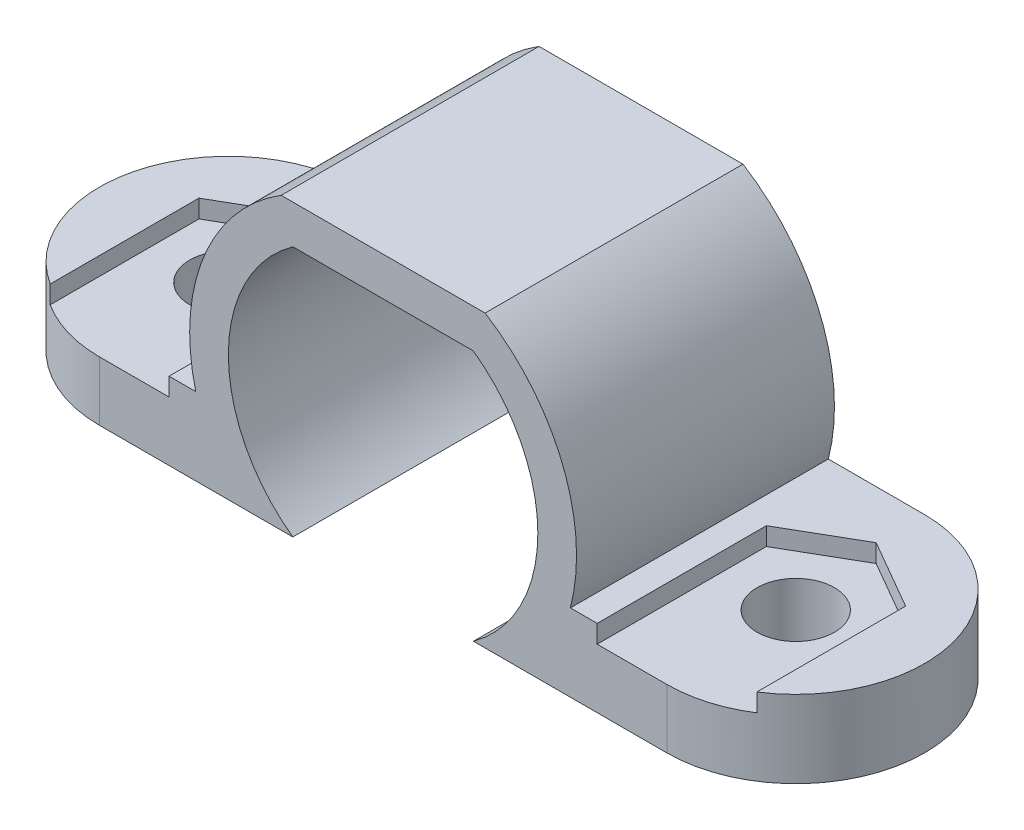
ISO-10303-21;
HEADER;
FILE_DESCRIPTION(('STEP AP214'),'2;1');
FILE_NAME('part.step','',(''),(''),'','','');
FILE_SCHEMA(('AUTOMOTIVE_DESIGN { 1 0 10303 214 1 1 1 1 }'));
ENDSEC;
DATA;
#1=APPLICATION_CONTEXT('core data for automotive mechanical design processes');
#2=APPLICATION_PROTOCOL_DEFINITION('international standard','automotive_design',2000,#1);
#3=PRODUCT_CONTEXT('',#1,'mechanical');
#4=PRODUCT('Part','Part','',(#3));
#5=PRODUCT_RELATED_PRODUCT_CATEGORY('part','',(#4));
#6=PRODUCT_DEFINITION_FORMATION('','',#4);
#7=PRODUCT_DEFINITION_CONTEXT('part definition',#1,'design');
#8=PRODUCT_DEFINITION('design','',#6,#7);
#9=PRODUCT_DEFINITION_SHAPE('','',#8);
#10=(LENGTH_UNIT() NAMED_UNIT(*) SI_UNIT(.MILLI.,.METRE.));
#11=(NAMED_UNIT(*) PLANE_ANGLE_UNIT() SI_UNIT($,.RADIAN.));
#12=(NAMED_UNIT(*) SI_UNIT($,.STERADIAN.) SOLID_ANGLE_UNIT());
#13=UNCERTAINTY_MEASURE_WITH_UNIT(LENGTH_MEASURE(1.E-05),#10,'distance_accuracy_value','');
#14=(GEOMETRIC_REPRESENTATION_CONTEXT(3) GLOBAL_UNCERTAINTY_ASSIGNED_CONTEXT((#13)) GLOBAL_UNIT_ASSIGNED_CONTEXT((#10,
#11,#12)) REPRESENTATION_CONTEXT('',''));
#15=CARTESIAN_POINT('',(0.,0.,0.));
#16=DIRECTION('',(0.,0.,1.));
#17=DIRECTION('',(1.,0.,0.));
#18=AXIS2_PLACEMENT_3D('',#15,#16,#17);
#19=CARTESIAN_POINT('',(7.26225743377546,-1.87339717240448,10.));
#20=DIRECTION('',(0.,-1.,0.));
#21=DIRECTION('',(0.,0.,-1.));
#22=AXIS2_PLACEMENT_3D('',#19,#20,#21);
#23=PLANE('',#22);
#24=DIRECTION('',(-1.,0.,0.));
#25=VECTOR('',#24,1.);
#26=CARTESIAN_POINT('',(7.26225743377546,-1.87339717240448,10.));
#27=LINE('',#26,#25);
#28=CARTESIAN_POINT('',(8.3,-1.87339717240448,10.));
#29=VERTEX_POINT('',#28);
#30=CARTESIAN_POINT('',(7.26225743377546,-1.87339717240448,10.));
#31=VERTEX_POINT('',#30);
#32=EDGE_CURVE('E300',#29,#31,#27,.T.);
#33=ORIENTED_EDGE('',*,*,#32,.F.);
#34=DIRECTION('',(0.,0.,-1.));
#35=VECTOR('',#34,1.);
#36=CARTESIAN_POINT('',(8.3,-1.87339717240448,6.55884572681199));
#37=LINE('',#36,#35);
#38=CARTESIAN_POINT('',(8.3,-1.87339717240448,3.44115427318801));
#39=VERTEX_POINT('',#38);
#40=EDGE_CURVE('E204',#29,#39,#37,.T.);
#41=ORIENTED_EDGE('',*,*,#40,.T.);
#42=DIRECTION('',(0.866025403784438,0.,-0.500000000000001));
#43=VECTOR('',#42,1.);
#44=CARTESIAN_POINT('',(8.3,-1.87339717240448,3.44115427318801));
#45=LINE('',#44,#43);
#46=CARTESIAN_POINT('',(11.,-1.87339717240448,1.88230854637602));
#47=VERTEX_POINT('',#46);
#48=EDGE_CURVE('E228',#39,#47,#45,.T.);
#49=ORIENTED_EDGE('',*,*,#48,.T.);
#50=DIRECTION('',(0.866025403784439,0.,0.499999999999999));
#51=VECTOR('',#50,1.);
#52=CARTESIAN_POINT('',(11.,-1.87339717240448,1.88230854637602));
#53=LINE('',#52,#51);
#54=CARTESIAN_POINT('',(13.7,-1.87339717240448,3.44115427318801));
#55=VERTEX_POINT('',#54);
#56=EDGE_CURVE('E225',#47,#55,#53,.T.);
#57=ORIENTED_EDGE('',*,*,#56,.T.);
#58=DIRECTION('',(0.,0.,1.));
#59=VECTOR('',#58,1.);
#60=CARTESIAN_POINT('',(13.7,-1.87339717240448,3.44115427318801));
#61=LINE('',#60,#59);
#62=CARTESIAN_POINT('',(13.7,-1.87339717240448,9.20832508250017));
#63=VERTEX_POINT('',#62);
#64=EDGE_CURVE('E54',#55,#63,#61,.T.);
#65=ORIENTED_EDGE('',*,*,#64,.T.);
#66=CARTESIAN_POINT('',(11.,-1.87339717240448,5.));
#67=DIRECTION('',(0.,-1.,0.));
#68=DIRECTION('',(0.,0.,-1.));
#69=AXIS2_PLACEMENT_3D('',#66,#67,#68);
#70=CIRCLE('',#69,5.);
#71=CARTESIAN_POINT('',(11.,-1.87339717240448,0.));
#72=VERTEX_POINT('',#71);
#73=EDGE_CURVE('E11',#63,#72,#70,.F.);
#74=ORIENTED_EDGE('',*,*,#73,.T.);
#75=DIRECTION('',(-1.,0.,0.));
#76=VECTOR('',#75,1.);
#77=CARTESIAN_POINT('',(7.26225743377546,-1.87339717240448,0.));
#78=LINE('',#77,#76);
#79=CARTESIAN_POINT('',(7.26225743377546,-1.87339717240448,0.));
#80=VERTEX_POINT('',#79);
#81=EDGE_CURVE('E323',#72,#80,#78,.T.);
#82=ORIENTED_EDGE('',*,*,#81,.T.);
#83=DIRECTION('',(0.,0.,-1.));
#84=VECTOR('',#83,1.);
#85=CARTESIAN_POINT('',(7.26225743377546,-1.87339717240448,10.));
#86=LINE('',#85,#84);
#87=EDGE_CURVE('E333',#31,#80,#86,.T.);
#88=ORIENTED_EDGE('',*,*,#87,.F.);
#89=EDGE_LOOP('',(#33,#41,#49,#57,#65,#74,#82,#88));
#90=FACE_BOUND('',#89,.T.);
#91=ADVANCED_FACE('F36',(#90),#23,.F.);
#92=CARTESIAN_POINT('',(11.,-4.87339717240448,5.));
#93=DIRECTION('',(0.,1.,0.));
#94=DIRECTION('',(0.,0.,1.));
#95=AXIS2_PLACEMENT_3D('',#92,#93,#94);
#96=CYLINDRICAL_SURFACE('',#95,5.);
#97=ORIENTED_EDGE('',*,*,#73,.F.);
#98=DIRECTION('',(0.,1.,0.));
#99=VECTOR('',#98,1.);
#100=CARTESIAN_POINT('',(13.7,-4.87339717240448,9.20832508250017));
#101=LINE('',#100,#99);
#102=CARTESIAN_POINT('',(13.7,-2.57339717240448,9.20832508250017));
#103=VERTEX_POINT('',#102);
#104=EDGE_CURVE('E214',#63,#103,#101,.F.);
#105=ORIENTED_EDGE('',*,*,#104,.T.);
#106=CARTESIAN_POINT('',(11.,-2.57339717240448,5.));
#107=DIRECTION('',(0.,1.,0.));
#108=DIRECTION('',(0.,0.,1.));
#109=AXIS2_PLACEMENT_3D('',#106,#107,#108);
#110=CIRCLE('',#109,5.);
#111=CARTESIAN_POINT('',(11.,-2.57339717240448,10.));
#112=VERTEX_POINT('',#111);
#113=EDGE_CURVE('E212',#103,#112,#110,.F.);
#114=ORIENTED_EDGE('',*,*,#113,.T.);
#115=DIRECTION('',(0.,-1.,0.));
#116=VECTOR('',#115,1.);
#117=CARTESIAN_POINT('',(11.,-4.87339717240448,10.));
#118=LINE('',#117,#116);
#119=CARTESIAN_POINT('',(11.,-4.87339717240448,10.));
#120=VERTEX_POINT('',#119);
#121=EDGE_CURVE('E211',#120,#112,#118,.F.);
#122=ORIENTED_EDGE('',*,*,#121,.F.);
#123=CARTESIAN_POINT('',(11.,-4.87339717240448,5.));
#124=DIRECTION('',(0.,1.,0.));
#125=DIRECTION('',(0.,0.,1.));
#126=AXIS2_PLACEMENT_3D('',#123,#124,#125);
#127=CIRCLE('',#126,5.);
#128=CARTESIAN_POINT('',(11.,-4.87339717240448,0.));
#129=VERTEX_POINT('',#128);
#130=EDGE_CURVE('E46',#129,#120,#127,.F.);
#131=ORIENTED_EDGE('',*,*,#130,.F.);
#132=DIRECTION('',(0.,1.,0.));
#133=VECTOR('',#132,1.);
#134=CARTESIAN_POINT('',(11.,0.,0.));
#135=LINE('',#134,#133);
#136=EDGE_CURVE('E362',#72,#129,#135,.F.);
#137=ORIENTED_EDGE('',*,*,#136,.F.);
#138=EDGE_LOOP('',(#97,#105,#114,#122,#131,#137));
#139=FACE_BOUND('',#138,.T.);
#140=ADVANCED_FACE('F39',(#139),#96,.T.);
#141=CARTESIAN_POINT('',(0.,0.,10.));
#142=DIRECTION('',(0.,0.,1.));
#143=DIRECTION('',(1.,0.,0.));
#144=AXIS2_PLACEMENT_3D('',#141,#142,#143);
#145=PLANE('',#144);
#146=DIRECTION('',(-1.,0.,0.));
#147=VECTOR('',#146,1.);
#148=CARTESIAN_POINT('',(8.3,-2.57339717240448,10.));
#149=LINE('',#148,#147);
#150=CARTESIAN_POINT('',(8.3,-2.57339717240448,10.));
#151=VERTEX_POINT('',#150);
#152=EDGE_CURVE('E192',#112,#151,#149,.T.);
#153=ORIENTED_EDGE('',*,*,#152,.T.);
#154=DIRECTION('',(0.,1.,0.));
#155=VECTOR('',#154,1.);
#156=CARTESIAN_POINT('',(8.3,-1.87339717240448,10.));
#157=LINE('',#156,#155);
#158=EDGE_CURVE('E202',#151,#29,#157,.T.);
#159=ORIENTED_EDGE('',*,*,#158,.T.);
#160=ORIENTED_EDGE('',*,*,#32,.T.);
#161=CARTESIAN_POINT('',(0.,0.,10.));
#162=DIRECTION('',(0.,0.,1.));
#163=DIRECTION('',(1.,0.,0.));
#164=AXIS2_PLACEMENT_3D('',#161,#162,#163);
#165=CIRCLE('',#164,7.5);
#166=CARTESIAN_POINT('',(3.95345525873084,6.37339717240448,10.));
#167=VERTEX_POINT('',#166);
#168=EDGE_CURVE('E302',#31,#167,#165,.T.);
#169=ORIENTED_EDGE('',*,*,#168,.T.);
#170=DIRECTION('',(-1.,0.,0.));
#171=VECTOR('',#170,1.);
#172=CARTESIAN_POINT('',(-3.95345525873084,6.37339717240448,10.));
#173=LINE('',#172,#171);
#174=CARTESIAN_POINT('',(-3.95345525873084,6.37339717240448,10.));
#175=VERTEX_POINT('',#174);
#176=EDGE_CURVE('E304',#167,#175,#173,.T.);
#177=ORIENTED_EDGE('',*,*,#176,.T.);
#178=CARTESIAN_POINT('',(0.,0.,10.));
#179=DIRECTION('',(0.,0.,1.));
#180=DIRECTION('',(1.,0.,0.));
#181=AXIS2_PLACEMENT_3D('',#178,#179,#180);
#182=CIRCLE('',#181,7.5);
#183=CARTESIAN_POINT('',(-7.26225743377546,-1.87339717240448,10.));
#184=VERTEX_POINT('',#183);
#185=EDGE_CURVE('E283',#175,#184,#182,.T.);
#186=ORIENTED_EDGE('',*,*,#185,.T.);
#187=DIRECTION('',(-1.,0.,0.));
#188=VECTOR('',#187,1.);
#189=CARTESIAN_POINT('',(-16.,-1.87339717240448,10.));
#190=LINE('',#189,#188);
#191=CARTESIAN_POINT('',(-8.3,-1.87339717240448,10.));
#192=VERTEX_POINT('',#191);
#193=EDGE_CURVE('E286',#184,#192,#190,.T.);
#194=ORIENTED_EDGE('',*,*,#193,.T.);
#195=DIRECTION('',(0.,1.,0.));
#196=VECTOR('',#195,1.);
#197=CARTESIAN_POINT('',(-8.3,-1.87339717240448,10.));
#198=LINE('',#197,#196);
#199=CARTESIAN_POINT('',(-8.3,-2.57339717240448,10.));
#200=VERTEX_POINT('',#199);
#201=EDGE_CURVE('E237',#200,#192,#198,.T.);
#202=ORIENTED_EDGE('',*,*,#201,.F.);
#203=DIRECTION('',(1.,0.,0.));
#204=VECTOR('',#203,1.);
#205=CARTESIAN_POINT('',(-8.3,-2.57339717240448,10.));
#206=LINE('',#205,#204);
#207=CARTESIAN_POINT('',(-11.,-2.57339717240448,10.));
#208=VERTEX_POINT('',#207);
#209=EDGE_CURVE('E240',#208,#200,#206,.T.);
#210=ORIENTED_EDGE('',*,*,#209,.F.);
#211=DIRECTION('',(0.,1.,0.));
#212=VECTOR('',#211,1.);
#213=CARTESIAN_POINT('',(-11.,-1.87339717240448,10.));
#214=LINE('',#213,#212);
#215=CARTESIAN_POINT('',(-11.,-4.87339717240448,10.));
#216=VERTEX_POINT('',#215);
#217=EDGE_CURVE('E351',#208,#216,#214,.F.);
#218=ORIENTED_EDGE('',*,*,#217,.T.);
#219=DIRECTION('',(1.,0.,0.));
#220=VECTOR('',#219,1.);
#221=CARTESIAN_POINT('',(-16.,-4.87339717240448,10.));
#222=LINE('',#221,#220);
#223=CARTESIAN_POINT('',(-3.5,-4.87339717240448,10.));
#224=VERTEX_POINT('',#223);
#225=EDGE_CURVE('E290',#216,#224,#222,.T.);
#226=ORIENTED_EDGE('',*,*,#225,.T.);
#227=CARTESIAN_POINT('',(0.,0.,10.));
#228=DIRECTION('',(0.,0.,-1.));
#229=DIRECTION('',(1.,0.,0.));
#230=AXIS2_PLACEMENT_3D('',#227,#228,#229);
#231=CIRCLE('',#230,6.);
#232=CARTESIAN_POINT('',(-3.5,4.87339717240448,10.));
#233=VERTEX_POINT('',#232);
#234=EDGE_CURVE('E292',#224,#233,#231,.T.);
#235=ORIENTED_EDGE('',*,*,#234,.T.);
#236=DIRECTION('',(1.,0.,0.));
#237=VECTOR('',#236,1.);
#238=CARTESIAN_POINT('',(-3.5,4.87339717240448,10.));
#239=LINE('',#238,#237);
#240=CARTESIAN_POINT('',(3.5,4.87339717240448,10.));
#241=VERTEX_POINT('',#240);
#242=EDGE_CURVE('E294',#233,#241,#239,.T.);
#243=ORIENTED_EDGE('',*,*,#242,.T.);
#244=CARTESIAN_POINT('',(0.,0.,10.));
#245=DIRECTION('',(0.,0.,-1.));
#246=DIRECTION('',(1.,0.,0.));
#247=AXIS2_PLACEMENT_3D('',#244,#245,#246);
#248=CIRCLE('',#247,6.);
#249=CARTESIAN_POINT('',(3.5,-4.87339717240448,10.));
#250=VERTEX_POINT('',#249);
#251=EDGE_CURVE('E296',#241,#250,#248,.T.);
#252=ORIENTED_EDGE('',*,*,#251,.T.);
#253=DIRECTION('',(1.,0.,0.));
#254=VECTOR('',#253,1.);
#255=CARTESIAN_POINT('',(3.5,-4.87339717240448,10.));
#256=LINE('',#255,#254);
#257=EDGE_CURVE('E298',#250,#120,#256,.T.);
#258=ORIENTED_EDGE('',*,*,#257,.T.);
#259=ORIENTED_EDGE('',*,*,#121,.T.);
#260=EDGE_LOOP('',(#153,#159,#160,#169,#177,#186,#194,#202,#210,#218,#226,#235,#243,#252,#258,#259));
#261=FACE_BOUND('',#260,.T.);
#262=ADVANCED_FACE('F209',(#261),#145,.T.);
#263=CARTESIAN_POINT('',(11.,-4.87339717240448,5.));
#264=DIRECTION('',(0.,1.,0.));
#265=DIRECTION('',(0.,0.,1.));
#266=AXIS2_PLACEMENT_3D('',#263,#264,#265);
#267=CYLINDRICAL_SURFACE('',#266,1.5);
#268=CARTESIAN_POINT('',(11.,-4.87339717240448,5.));
#269=DIRECTION('',(0.,1.,0.));
#270=DIRECTION('',(0.,0.,1.));
#271=AXIS2_PLACEMENT_3D('',#268,#269,#270);
#272=CIRCLE('',#271,1.5);
#273=CARTESIAN_POINT('',(11.,-4.87339717240448,6.5));
#274=VERTEX_POINT('',#273);
#275=EDGE_CURVE('E276',#274,#274,#272,.T.);
#276=ORIENTED_EDGE('',*,*,#275,.F.);
#277=EDGE_LOOP('',(#276));
#278=FACE_BOUND('',#277,.T.);
#279=CARTESIAN_POINT('',(11.,-2.57339717240448,5.));
#280=DIRECTION('',(0.,1.,0.));
#281=DIRECTION('',(0.,0.,1.));
#282=AXIS2_PLACEMENT_3D('',#279,#280,#281);
#283=CIRCLE('',#282,1.5);
#284=CARTESIAN_POINT('',(11.,-2.57339717240448,6.5));
#285=VERTEX_POINT('',#284);
#286=EDGE_CURVE('E41',#285,#285,#283,.F.);
#287=ORIENTED_EDGE('',*,*,#286,.F.);
#288=EDGE_LOOP('',(#287));
#289=FACE_BOUND('',#288,.T.);
#290=ADVANCED_FACE('F373',(#278,#289),#267,.F.);
#291=CARTESIAN_POINT('',(-11.,-4.87339717240448,5.));
#292=DIRECTION('',(0.,1.,0.));
#293=DIRECTION('',(0.,0.,1.));
#294=AXIS2_PLACEMENT_3D('',#291,#292,#293);
#295=CYLINDRICAL_SURFACE('',#294,1.5);
#296=CARTESIAN_POINT('',(-11.,-4.87339717240448,5.));
#297=DIRECTION('',(0.,1.,0.));
#298=DIRECTION('',(0.,0.,1.));
#299=AXIS2_PLACEMENT_3D('',#296,#297,#298);
#300=CIRCLE('',#299,1.5);
#301=CARTESIAN_POINT('',(-11.,-4.87339717240448,6.5));
#302=VERTEX_POINT('',#301);
#303=EDGE_CURVE('E279',#302,#302,#300,.T.);
#304=ORIENTED_EDGE('',*,*,#303,.F.);
#305=EDGE_LOOP('',(#304));
#306=FACE_BOUND('',#305,.T.);
#307=CARTESIAN_POINT('',(-11.,-2.57339717240448,5.));
#308=DIRECTION('',(0.,1.,0.));
#309=DIRECTION('',(0.,0.,1.));
#310=AXIS2_PLACEMENT_3D('',#307,#308,#309);
#311=CIRCLE('',#310,1.5);
#312=CARTESIAN_POINT('',(-11.,-2.57339717240448,6.5));
#313=VERTEX_POINT('',#312);
#314=EDGE_CURVE('E271',#313,#313,#311,.F.);
#315=ORIENTED_EDGE('',*,*,#314,.F.);
#316=EDGE_LOOP('',(#315));
#317=FACE_BOUND('',#316,.T.);
#318=ADVANCED_FACE('F370',(#306,#317),#295,.F.);
#319=CARTESIAN_POINT('',(-11.,-1.87339717240448,5.));
#320=DIRECTION('',(0.,-1.,0.));
#321=DIRECTION('',(0.,0.,-1.));
#322=AXIS2_PLACEMENT_3D('',#319,#320,#321);
#323=CYLINDRICAL_SURFACE('',#322,5.);
#324=CARTESIAN_POINT('',(-11.,-2.57339717240448,5.));
#325=DIRECTION('',(0.,-1.,0.));
#326=DIRECTION('',(0.,0.,-1.));
#327=AXIS2_PLACEMENT_3D('',#324,#325,#326);
#328=CIRCLE('',#327,5.);
#329=CARTESIAN_POINT('',(-13.7,-2.57339717240448,9.20832508250017));
#330=VERTEX_POINT('',#329);
#331=EDGE_CURVE('E246',#330,#208,#328,.F.);
#332=ORIENTED_EDGE('',*,*,#331,.F.);
#333=DIRECTION('',(0.,-1.,0.));
#334=VECTOR('',#333,1.);
#335=CARTESIAN_POINT('',(-13.7,-1.87339717240448,9.20832508250017));
#336=LINE('',#335,#334);
#337=CARTESIAN_POINT('',(-13.7,-1.87339717240448,9.20832508250017));
#338=VERTEX_POINT('',#337);
#339=EDGE_CURVE('E243',#338,#330,#336,.T.);
#340=ORIENTED_EDGE('',*,*,#339,.F.);
#341=CARTESIAN_POINT('',(-11.,-1.87339717240448,5.));
#342=DIRECTION('',(0.,-1.,0.));
#343=DIRECTION('',(0.,0.,-1.));
#344=AXIS2_PLACEMENT_3D('',#341,#342,#343);
#345=CIRCLE('',#344,5.);
#346=CARTESIAN_POINT('',(-11.,-1.87339717240448,0.));
#347=VERTEX_POINT('',#346);
#348=EDGE_CURVE('E356',#347,#338,#345,.F.);
#349=ORIENTED_EDGE('',*,*,#348,.F.);
#350=DIRECTION('',(0.,-1.,0.));
#351=VECTOR('',#350,1.);
#352=CARTESIAN_POINT('',(-11.,0.,0.));
#353=LINE('',#352,#351);
#354=CARTESIAN_POINT('',(-11.,-4.87339717240448,0.));
#355=VERTEX_POINT('',#354);
#356=EDGE_CURVE('E353',#355,#347,#353,.F.);
#357=ORIENTED_EDGE('',*,*,#356,.F.);
#358=CARTESIAN_POINT('',(-11.,-4.87339717240448,5.));
#359=DIRECTION('',(0.,1.,0.));
#360=DIRECTION('',(0.,0.,1.));
#361=AXIS2_PLACEMENT_3D('',#358,#359,#360);
#362=CIRCLE('',#361,5.);
#363=EDGE_CURVE('E359',#216,#355,#362,.F.);
#364=ORIENTED_EDGE('',*,*,#363,.F.);
#365=ORIENTED_EDGE('',*,*,#217,.F.);
#366=EDGE_LOOP('',(#332,#340,#349,#357,#364,#365));
#367=FACE_BOUND('',#366,.T.);
#368=ADVANCED_FACE('F372',(#367),#323,.T.);
#369=CARTESIAN_POINT('',(0.,0.,10.));
#370=DIRECTION('',(0.,0.,-1.));
#371=DIRECTION('',(-1.,0.,0.));
#372=AXIS2_PLACEMENT_3D('',#369,#370,#371);
#373=CYLINDRICAL_SURFACE('',#372,7.5);
#374=CARTESIAN_POINT('',(0.,0.,0.));
#375=DIRECTION('',(0.,0.,1.));
#376=DIRECTION('',(1.,0.,0.));
#377=AXIS2_PLACEMENT_3D('',#374,#375,#376);
#378=CIRCLE('',#377,7.5);
#379=CARTESIAN_POINT('',(-3.95345525873084,6.37339717240448,0.));
#380=VERTEX_POINT('',#379);
#381=CARTESIAN_POINT('',(-7.26225743377546,-1.87339717240448,0.));
#382=VERTEX_POINT('',#381);
#383=EDGE_CURVE('E282',#380,#382,#378,.T.);
#384=ORIENTED_EDGE('',*,*,#383,.T.);
#385=DIRECTION('',(0.,0.,-1.));
#386=VECTOR('',#385,1.);
#387=CARTESIAN_POINT('',(-7.26225743377546,-1.87339717240448,10.));
#388=LINE('',#387,#386);
#389=EDGE_CURVE('E348',#184,#382,#388,.T.);
#390=ORIENTED_EDGE('',*,*,#389,.F.);
#391=ORIENTED_EDGE('',*,*,#185,.F.);
#392=DIRECTION('',(0.,0.,-1.));
#393=VECTOR('',#392,1.);
#394=CARTESIAN_POINT('',(-3.95345525873084,6.37339717240448,10.));
#395=LINE('',#394,#393);
#396=EDGE_CURVE('E306',#175,#380,#395,.T.);
#397=ORIENTED_EDGE('',*,*,#396,.T.);
#398=EDGE_LOOP('',(#384,#390,#391,#397));
#399=FACE_BOUND('',#398,.T.);
#400=ADVANCED_FACE('F380',(#399),#373,.T.);
#401=CARTESIAN_POINT('',(-16.,-1.87339717240448,10.));
#402=DIRECTION('',(0.,-1.,0.));
#403=DIRECTION('',(0.,0.,-1.));
#404=AXIS2_PLACEMENT_3D('',#401,#402,#403);
#405=PLANE('',#404);
#406=DIRECTION('',(0.,0.,-1.));
#407=VECTOR('',#406,1.);
#408=CARTESIAN_POINT('',(-8.3,-1.87339717240448,6.55884572681199));
#409=LINE('',#408,#407);
#410=CARTESIAN_POINT('',(-8.3,-1.87339717240448,3.44115427318801));
#411=VERTEX_POINT('',#410);
#412=EDGE_CURVE('E262',#192,#411,#409,.T.);
#413=ORIENTED_EDGE('',*,*,#412,.F.);
#414=ORIENTED_EDGE('',*,*,#193,.F.);
#415=ORIENTED_EDGE('',*,*,#389,.T.);
#416=DIRECTION('',(-1.,0.,0.));
#417=VECTOR('',#416,1.);
#418=CARTESIAN_POINT('',(-16.,-1.87339717240448,0.));
#419=LINE('',#418,#417);
#420=EDGE_CURVE('E309',#382,#347,#419,.T.);
#421=ORIENTED_EDGE('',*,*,#420,.T.);
#422=ORIENTED_EDGE('',*,*,#348,.T.);
#423=DIRECTION('',(0.,0.,1.));
#424=VECTOR('',#423,1.);
#425=CARTESIAN_POINT('',(-13.7,-1.87339717240448,3.44115427318801));
#426=LINE('',#425,#424);
#427=CARTESIAN_POINT('',(-13.7,-1.87339717240448,3.44115427318801));
#428=VERTEX_POINT('',#427);
#429=EDGE_CURVE('E248',#428,#338,#426,.T.);
#430=ORIENTED_EDGE('',*,*,#429,.F.);
#431=DIRECTION('',(-0.866025403784439,0.,0.499999999999999));
#432=VECTOR('',#431,1.);
#433=CARTESIAN_POINT('',(-11.,-1.87339717240448,1.88230854637602));
#434=LINE('',#433,#432);
#435=CARTESIAN_POINT('',(-11.,-1.87339717240448,1.88230854637602));
#436=VERTEX_POINT('',#435);
#437=EDGE_CURVE('E252',#436,#428,#434,.T.);
#438=ORIENTED_EDGE('',*,*,#437,.F.);
#439=DIRECTION('',(-0.866025403784438,0.,-0.500000000000001));
#440=VECTOR('',#439,1.);
#441=CARTESIAN_POINT('',(-8.3,-1.87339717240448,3.44115427318801));
#442=LINE('',#441,#440);
#443=EDGE_CURVE('E264',#411,#436,#442,.T.);
#444=ORIENTED_EDGE('',*,*,#443,.F.);
#445=EDGE_LOOP('',(#413,#414,#415,#421,#422,#430,#438,#444));
#446=FACE_BOUND('',#445,.T.);
#447=ADVANCED_FACE('F415',(#446),#405,.F.);
#448=CARTESIAN_POINT('',(-16.,-4.87339717240448,10.));
#449=DIRECTION('',(0.,1.,0.));
#450=DIRECTION('',(0.,0.,1.));
#451=AXIS2_PLACEMENT_3D('',#448,#449,#450);
#452=PLANE('',#451);
#453=ORIENTED_EDGE('',*,*,#303,.T.);
#454=EDGE_LOOP('',(#453));
#455=FACE_BOUND('',#454,.T.);
#456=ORIENTED_EDGE('',*,*,#225,.F.);
#457=ORIENTED_EDGE('',*,*,#363,.T.);
#458=DIRECTION('',(1.,0.,0.));
#459=VECTOR('',#458,1.);
#460=CARTESIAN_POINT('',(-16.,-4.87339717240448,0.));
#461=LINE('',#460,#459);
#462=CARTESIAN_POINT('',(-3.5,-4.87339717240448,0.));
#463=VERTEX_POINT('',#462);
#464=EDGE_CURVE('E312',#355,#463,#461,.T.);
#465=ORIENTED_EDGE('',*,*,#464,.T.);
#466=DIRECTION('',(0.,0.,-1.));
#467=VECTOR('',#466,1.);
#468=CARTESIAN_POINT('',(-3.5,-4.87339717240448,10.));
#469=LINE('',#468,#467);
#470=EDGE_CURVE('E345',#224,#463,#469,.T.);
#471=ORIENTED_EDGE('',*,*,#470,.F.);
#472=EDGE_LOOP('',(#456,#457,#465,#471));
#473=FACE_BOUND('',#472,.T.);
#474=ADVANCED_FACE('F411',(#455,#473),#452,.F.);
#475=CARTESIAN_POINT('',(0.,0.,10.));
#476=DIRECTION('',(0.,0.,-1.));
#477=DIRECTION('',(-1.,0.,0.));
#478=AXIS2_PLACEMENT_3D('',#475,#476,#477);
#479=CYLINDRICAL_SURFACE('',#478,6.);
#480=CARTESIAN_POINT('',(0.,0.,0.));
#481=DIRECTION('',(0.,0.,-1.));
#482=DIRECTION('',(1.,0.,0.));
#483=AXIS2_PLACEMENT_3D('',#480,#481,#482);
#484=CIRCLE('',#483,6.);
#485=CARTESIAN_POINT('',(-3.5,4.87339717240448,0.));
#486=VERTEX_POINT('',#485);
#487=EDGE_CURVE('E314',#463,#486,#484,.T.);
#488=ORIENTED_EDGE('',*,*,#487,.T.);
#489=DIRECTION('',(0.,0.,-1.));
#490=VECTOR('',#489,1.);
#491=CARTESIAN_POINT('',(-3.5,4.87339717240448,10.));
#492=LINE('',#491,#490);
#493=EDGE_CURVE('E342',#233,#486,#492,.T.);
#494=ORIENTED_EDGE('',*,*,#493,.F.);
#495=ORIENTED_EDGE('',*,*,#234,.F.);
#496=ORIENTED_EDGE('',*,*,#470,.T.);
#497=EDGE_LOOP('',(#488,#494,#495,#496));
#498=FACE_BOUND('',#497,.T.);
#499=ADVANCED_FACE('F407',(#498),#479,.F.);
#500=CARTESIAN_POINT('',(-3.5,4.87339717240448,10.));
#501=DIRECTION('',(0.,1.,0.));
#502=DIRECTION('',(0.,0.,1.));
#503=AXIS2_PLACEMENT_3D('',#500,#501,#502);
#504=PLANE('',#503);
#505=DIRECTION('',(1.,0.,0.));
#506=VECTOR('',#505,1.);
#507=CARTESIAN_POINT('',(-3.5,4.87339717240448,0.));
#508=LINE('',#507,#506);
#509=CARTESIAN_POINT('',(3.5,4.87339717240448,0.));
#510=VERTEX_POINT('',#509);
#511=EDGE_CURVE('E316',#486,#510,#508,.T.);
#512=ORIENTED_EDGE('',*,*,#511,.T.);
#513=DIRECTION('',(0.,0.,-1.));
#514=VECTOR('',#513,1.);
#515=CARTESIAN_POINT('',(3.5,4.87339717240448,10.));
#516=LINE('',#515,#514);
#517=EDGE_CURVE('E339',#241,#510,#516,.T.);
#518=ORIENTED_EDGE('',*,*,#517,.F.);
#519=ORIENTED_EDGE('',*,*,#242,.F.);
#520=ORIENTED_EDGE('',*,*,#493,.T.);
#521=EDGE_LOOP('',(#512,#518,#519,#520));
#522=FACE_BOUND('',#521,.T.);
#523=ADVANCED_FACE('F403',(#522),#504,.F.);
#524=CARTESIAN_POINT('',(0.,0.,10.));
#525=DIRECTION('',(0.,0.,-1.));
#526=DIRECTION('',(-1.,0.,0.));
#527=AXIS2_PLACEMENT_3D('',#524,#525,#526);
#528=CYLINDRICAL_SURFACE('',#527,6.);
#529=CARTESIAN_POINT('',(0.,0.,0.));
#530=DIRECTION('',(0.,0.,-1.));
#531=DIRECTION('',(1.,0.,0.));
#532=AXIS2_PLACEMENT_3D('',#529,#530,#531);
#533=CIRCLE('',#532,6.);
#534=CARTESIAN_POINT('',(3.5,-4.87339717240448,0.));
#535=VERTEX_POINT('',#534);
#536=EDGE_CURVE('E318',#510,#535,#533,.T.);
#537=ORIENTED_EDGE('',*,*,#536,.T.);
#538=DIRECTION('',(0.,0.,-1.));
#539=VECTOR('',#538,1.);
#540=CARTESIAN_POINT('',(3.5,-4.87339717240448,10.));
#541=LINE('',#540,#539);
#542=EDGE_CURVE('E336',#250,#535,#541,.T.);
#543=ORIENTED_EDGE('',*,*,#542,.F.);
#544=ORIENTED_EDGE('',*,*,#251,.F.);
#545=ORIENTED_EDGE('',*,*,#517,.T.);
#546=EDGE_LOOP('',(#537,#543,#544,#545));
#547=FACE_BOUND('',#546,.T.);
#548=ADVANCED_FACE('F399',(#547),#528,.F.);
#549=CARTESIAN_POINT('',(3.5,-4.87339717240448,10.));
#550=DIRECTION('',(0.,1.,0.));
#551=DIRECTION('',(0.,0.,1.));
#552=AXIS2_PLACEMENT_3D('',#549,#550,#551);
#553=PLANE('',#552);
#554=ORIENTED_EDGE('',*,*,#275,.T.);
#555=EDGE_LOOP('',(#554));
#556=FACE_BOUND('',#555,.T.);
#557=DIRECTION('',(1.,0.,0.));
#558=VECTOR('',#557,1.);
#559=CARTESIAN_POINT('',(3.5,-4.87339717240448,0.));
#560=LINE('',#559,#558);
#561=EDGE_CURVE('E320',#535,#129,#560,.T.);
#562=ORIENTED_EDGE('',*,*,#561,.T.);
#563=ORIENTED_EDGE('',*,*,#130,.T.);
#564=ORIENTED_EDGE('',*,*,#257,.F.);
#565=ORIENTED_EDGE('',*,*,#542,.T.);
#566=EDGE_LOOP('',(#562,#563,#564,#565));
#567=FACE_BOUND('',#566,.T.);
#568=ADVANCED_FACE('F396',(#556,#567),#553,.F.);
#569=CARTESIAN_POINT('',(0.,0.,10.));
#570=DIRECTION('',(0.,0.,-1.));
#571=DIRECTION('',(-1.,0.,0.));
#572=AXIS2_PLACEMENT_3D('',#569,#570,#571);
#573=CYLINDRICAL_SURFACE('',#572,7.5);
#574=CARTESIAN_POINT('',(0.,0.,0.));
#575=DIRECTION('',(0.,0.,1.));
#576=DIRECTION('',(1.,0.,0.));
#577=AXIS2_PLACEMENT_3D('',#574,#575,#576);
#578=CIRCLE('',#577,7.5);
#579=CARTESIAN_POINT('',(3.95345525873084,6.37339717240448,0.));
#580=VERTEX_POINT('',#579);
#581=EDGE_CURVE('E325',#80,#580,#578,.T.);
#582=ORIENTED_EDGE('',*,*,#581,.T.);
#583=DIRECTION('',(0.,0.,-1.));
#584=VECTOR('',#583,1.);
#585=CARTESIAN_POINT('',(3.95345525873084,6.37339717240448,10.));
#586=LINE('',#585,#584);
#587=EDGE_CURVE('E330',#167,#580,#586,.T.);
#588=ORIENTED_EDGE('',*,*,#587,.F.);
#589=ORIENTED_EDGE('',*,*,#168,.F.);
#590=ORIENTED_EDGE('',*,*,#87,.T.);
#591=EDGE_LOOP('',(#582,#588,#589,#590));
#592=FACE_BOUND('',#591,.T.);
#593=ADVANCED_FACE('F394',(#592),#573,.T.);
#594=CARTESIAN_POINT('',(-3.95345525873084,6.37339717240448,10.));
#595=DIRECTION('',(0.,-1.,0.));
#596=DIRECTION('',(0.,0.,-1.));
#597=AXIS2_PLACEMENT_3D('',#594,#595,#596);
#598=PLANE('',#597);
#599=DIRECTION('',(-1.,0.,0.));
#600=VECTOR('',#599,1.);
#601=CARTESIAN_POINT('',(-3.95345525873084,6.37339717240448,0.));
#602=LINE('',#601,#600);
#603=EDGE_CURVE('E287',#580,#380,#602,.T.);
#604=ORIENTED_EDGE('',*,*,#603,.T.);
#605=ORIENTED_EDGE('',*,*,#396,.F.);
#606=ORIENTED_EDGE('',*,*,#176,.F.);
#607=ORIENTED_EDGE('',*,*,#587,.T.);
#608=EDGE_LOOP('',(#604,#605,#606,#607));
#609=FACE_BOUND('',#608,.T.);
#610=ADVANCED_FACE('F446',(#609),#598,.F.);
#611=CARTESIAN_POINT('',(0.,0.,0.));
#612=DIRECTION('',(0.,0.,1.));
#613=DIRECTION('',(1.,0.,0.));
#614=AXIS2_PLACEMENT_3D('',#611,#612,#613);
#615=PLANE('',#614);
#616=ORIENTED_EDGE('',*,*,#81,.F.);
#617=ORIENTED_EDGE('',*,*,#136,.T.);
#618=ORIENTED_EDGE('',*,*,#561,.F.);
#619=ORIENTED_EDGE('',*,*,#536,.F.);
#620=ORIENTED_EDGE('',*,*,#511,.F.);
#621=ORIENTED_EDGE('',*,*,#487,.F.);
#622=ORIENTED_EDGE('',*,*,#464,.F.);
#623=ORIENTED_EDGE('',*,*,#356,.T.);
#624=ORIENTED_EDGE('',*,*,#420,.F.);
#625=ORIENTED_EDGE('',*,*,#383,.F.);
#626=ORIENTED_EDGE('',*,*,#603,.F.);
#627=ORIENTED_EDGE('',*,*,#581,.F.);
#628=EDGE_LOOP('',(#616,#617,#618,#619,#620,#621,#622,#623,#624,#625,#626,#627));
#629=FACE_BOUND('',#628,.T.);
#630=ADVANCED_FACE('F436',(#629),#615,.F.);
#631=CARTESIAN_POINT('',(0.,-2.57339717240448,0.));
#632=DIRECTION('',(0.,1.,0.));
#633=DIRECTION('',(0.,0.,1.));
#634=AXIS2_PLACEMENT_3D('',#631,#632,#633);
#635=PLANE('',#634);
#636=ORIENTED_EDGE('',*,*,#314,.T.);
#637=EDGE_LOOP('',(#636));
#638=FACE_BOUND('',#637,.T.);
#639=DIRECTION('',(0.,0.,-1.));
#640=VECTOR('',#639,1.);
#641=CARTESIAN_POINT('',(-8.3,-2.57339717240448,6.55884572681199));
#642=LINE('',#641,#640);
#643=CARTESIAN_POINT('',(-8.3,-2.57339717240448,3.44115427318801));
#644=VERTEX_POINT('',#643);
#645=EDGE_CURVE('E251',#200,#644,#642,.T.);
#646=ORIENTED_EDGE('',*,*,#645,.T.);
#647=DIRECTION('',(-0.866025403784438,0.,-0.500000000000001));
#648=VECTOR('',#647,1.);
#649=CARTESIAN_POINT('',(-8.3,-2.57339717240448,3.44115427318801));
#650=LINE('',#649,#648);
#651=CARTESIAN_POINT('',(-11.,-2.57339717240448,1.88230854637602));
#652=VERTEX_POINT('',#651);
#653=EDGE_CURVE('E254',#644,#652,#650,.T.);
#654=ORIENTED_EDGE('',*,*,#653,.T.);
#655=DIRECTION('',(-0.866025403784439,0.,0.499999999999999));
#656=VECTOR('',#655,1.);
#657=CARTESIAN_POINT('',(-11.,-2.57339717240448,1.88230854637602));
#658=LINE('',#657,#656);
#659=CARTESIAN_POINT('',(-13.7,-2.57339717240448,3.44115427318801));
#660=VERTEX_POINT('',#659);
#661=EDGE_CURVE('E257',#652,#660,#658,.T.);
#662=ORIENTED_EDGE('',*,*,#661,.T.);
#663=DIRECTION('',(0.,0.,1.));
#664=VECTOR('',#663,1.);
#665=CARTESIAN_POINT('',(-13.7,-2.57339717240448,3.44115427318801));
#666=LINE('',#665,#664);
#667=EDGE_CURVE('E249',#660,#330,#666,.T.);
#668=ORIENTED_EDGE('',*,*,#667,.T.);
#669=ORIENTED_EDGE('',*,*,#331,.T.);
#670=ORIENTED_EDGE('',*,*,#209,.T.);
#671=EDGE_LOOP('',(#646,#654,#662,#668,#669,#670));
#672=FACE_BOUND('',#671,.T.);
#673=ADVANCED_FACE('F367',(#638,#672),#635,.T.);
#674=CARTESIAN_POINT('',(-13.7,-2.57339717240448,3.44115427318801));
#675=DIRECTION('',(-1.,0.,0.));
#676=DIRECTION('',(0.,0.,1.));
#677=AXIS2_PLACEMENT_3D('',#674,#675,#676);
#678=PLANE('',#677);
#679=ORIENTED_EDGE('',*,*,#429,.T.);
#680=ORIENTED_EDGE('',*,*,#339,.T.);
#681=ORIENTED_EDGE('',*,*,#667,.F.);
#682=DIRECTION('',(0.,1.,0.));
#683=VECTOR('',#682,1.);
#684=CARTESIAN_POINT('',(-13.7,-2.57339717240448,3.44115427318801));
#685=LINE('',#684,#683);
#686=EDGE_CURVE('E269',#660,#428,#685,.T.);
#687=ORIENTED_EDGE('',*,*,#686,.T.);
#688=EDGE_LOOP('',(#679,#680,#681,#687));
#689=FACE_BOUND('',#688,.T.);
#690=ADVANCED_FACE('F474',(#689),#678,.F.);
#691=CARTESIAN_POINT('',(-11.,-2.57339717240448,1.88230854637602));
#692=DIRECTION('',(-0.499999999999999,0.,-0.866025403784439));
#693=DIRECTION('',(-0.866025403784439,0.,0.499999999999999));
#694=AXIS2_PLACEMENT_3D('',#691,#692,#693);
#695=PLANE('',#694);
#696=ORIENTED_EDGE('',*,*,#437,.T.);
#697=ORIENTED_EDGE('',*,*,#686,.F.);
#698=ORIENTED_EDGE('',*,*,#661,.F.);
#699=DIRECTION('',(0.,1.,0.));
#700=VECTOR('',#699,1.);
#701=CARTESIAN_POINT('',(-11.,-2.57339717240448,1.88230854637602));
#702=LINE('',#701,#700);
#703=EDGE_CURVE('E272',#652,#436,#702,.T.);
#704=ORIENTED_EDGE('',*,*,#703,.T.);
#705=EDGE_LOOP('',(#696,#697,#698,#704));
#706=FACE_BOUND('',#705,.T.);
#707=ADVANCED_FACE('F475',(#706),#695,.F.);
#708=CARTESIAN_POINT('',(-8.3,-2.57339717240448,3.44115427318801));
#709=DIRECTION('',(0.500000000000001,0.,-0.866025403784438));
#710=DIRECTION('',(-0.866025403784438,0.,-0.500000000000001));
#711=AXIS2_PLACEMENT_3D('',#708,#709,#710);
#712=PLANE('',#711);
#713=ORIENTED_EDGE('',*,*,#443,.T.);
#714=ORIENTED_EDGE('',*,*,#703,.F.);
#715=ORIENTED_EDGE('',*,*,#653,.F.);
#716=DIRECTION('',(0.,1.,0.));
#717=VECTOR('',#716,1.);
#718=CARTESIAN_POINT('',(-8.3,-2.57339717240448,3.44115427318801));
#719=LINE('',#718,#717);
#720=EDGE_CURVE('E260',#644,#411,#719,.T.);
#721=ORIENTED_EDGE('',*,*,#720,.T.);
#722=EDGE_LOOP('',(#713,#714,#715,#721));
#723=FACE_BOUND('',#722,.T.);
#724=ADVANCED_FACE('F478',(#723),#712,.F.);
#725=CARTESIAN_POINT('',(-8.3,-2.57339717240448,6.55884572681199));
#726=DIRECTION('',(1.,0.,0.));
#727=DIRECTION('',(0.,0.,-1.));
#728=AXIS2_PLACEMENT_3D('',#725,#726,#727);
#729=PLANE('',#728);
#730=ORIENTED_EDGE('',*,*,#720,.F.);
#731=ORIENTED_EDGE('',*,*,#645,.F.);
#732=ORIENTED_EDGE('',*,*,#201,.T.);
#733=ORIENTED_EDGE('',*,*,#412,.T.);
#734=EDGE_LOOP('',(#730,#731,#732,#733));
#735=FACE_BOUND('',#734,.T.);
#736=ADVANCED_FACE('F482',(#735),#729,.F.);
#737=CARTESIAN_POINT('',(0.,-2.57339717240448,0.));
#738=DIRECTION('',(0.,1.,0.));
#739=DIRECTION('',(0.,0.,1.));
#740=AXIS2_PLACEMENT_3D('',#737,#738,#739);
#741=PLANE('',#740);
#742=ORIENTED_EDGE('',*,*,#286,.T.);
#743=EDGE_LOOP('',(#742));
#744=FACE_BOUND('',#743,.T.);
#745=ORIENTED_EDGE('',*,*,#113,.F.);
#746=DIRECTION('',(0.,0.,1.));
#747=VECTOR('',#746,1.);
#748=CARTESIAN_POINT('',(13.7,-2.57339717240448,3.44115427318801));
#749=LINE('',#748,#747);
#750=CARTESIAN_POINT('',(13.7,-2.57339717240448,3.44115427318801));
#751=VERTEX_POINT('',#750);
#752=EDGE_CURVE('E219',#751,#103,#749,.T.);
#753=ORIENTED_EDGE('',*,*,#752,.F.);
#754=DIRECTION('',(0.866025403784439,0.,0.499999999999999));
#755=VECTOR('',#754,1.);
#756=CARTESIAN_POINT('',(11.,-2.57339717240448,1.88230854637602));
#757=LINE('',#756,#755);
#758=CARTESIAN_POINT('',(11.,-2.57339717240448,1.88230854637602));
#759=VERTEX_POINT('',#758);
#760=EDGE_CURVE('E221',#759,#751,#757,.T.);
#761=ORIENTED_EDGE('',*,*,#760,.F.);
#762=DIRECTION('',(0.866025403784438,0.,-0.500000000000001));
#763=VECTOR('',#762,1.);
#764=CARTESIAN_POINT('',(8.3,-2.57339717240448,3.44115427318801));
#765=LINE('',#764,#763);
#766=CARTESIAN_POINT('',(8.3,-2.57339717240448,3.44115427318801));
#767=VERTEX_POINT('',#766);
#768=EDGE_CURVE('E195',#767,#759,#765,.T.);
#769=ORIENTED_EDGE('',*,*,#768,.F.);
#770=DIRECTION('',(0.,0.,-1.));
#771=VECTOR('',#770,1.);
#772=CARTESIAN_POINT('',(8.3,-2.57339717240448,6.55884572681199));
#773=LINE('',#772,#771);
#774=EDGE_CURVE('E187',#151,#767,#773,.T.);
#775=ORIENTED_EDGE('',*,*,#774,.F.);
#776=ORIENTED_EDGE('',*,*,#152,.F.);
#777=EDGE_LOOP('',(#745,#753,#761,#769,#775,#776));
#778=FACE_BOUND('',#777,.T.);
#779=ADVANCED_FACE('F190',(#744,#778),#741,.T.);
#780=CARTESIAN_POINT('',(13.7,-2.57339717240448,3.44115427318801));
#781=DIRECTION('',(-1.,0.,0.));
#782=DIRECTION('',(0.,0.,1.));
#783=AXIS2_PLACEMENT_3D('',#780,#781,#782);
#784=PLANE('',#783);
#785=ORIENTED_EDGE('',*,*,#752,.T.);
#786=ORIENTED_EDGE('',*,*,#104,.F.);
#787=ORIENTED_EDGE('',*,*,#64,.F.);
#788=DIRECTION('',(0.,1.,0.));
#789=VECTOR('',#788,1.);
#790=CARTESIAN_POINT('',(13.7,-2.57339717240448,3.44115427318801));
#791=LINE('',#790,#789);
#792=EDGE_CURVE('E199',#751,#55,#791,.T.);
#793=ORIENTED_EDGE('',*,*,#792,.F.);
#794=EDGE_LOOP('',(#785,#786,#787,#793));
#795=FACE_BOUND('',#794,.T.);
#796=ADVANCED_FACE('F451',(#795),#784,.T.);
#797=CARTESIAN_POINT('',(8.3,-2.57339717240448,6.55884572681199));
#798=DIRECTION('',(1.,0.,0.));
#799=DIRECTION('',(0.,0.,-1.));
#800=AXIS2_PLACEMENT_3D('',#797,#798,#799);
#801=PLANE('',#800);
#802=DIRECTION('',(0.,1.,0.));
#803=VECTOR('',#802,1.);
#804=CARTESIAN_POINT('',(8.3,-2.57339717240448,3.44115427318801));
#805=LINE('',#804,#803);
#806=EDGE_CURVE('E232',#767,#39,#805,.T.);
#807=ORIENTED_EDGE('',*,*,#806,.T.);
#808=ORIENTED_EDGE('',*,*,#40,.F.);
#809=ORIENTED_EDGE('',*,*,#158,.F.);
#810=ORIENTED_EDGE('',*,*,#774,.T.);
#811=EDGE_LOOP('',(#807,#808,#809,#810));
#812=FACE_BOUND('',#811,.T.);
#813=ADVANCED_FACE('F203',(#812),#801,.T.);
#814=CARTESIAN_POINT('',(8.3,-2.57339717240448,3.44115427318801));
#815=DIRECTION('',(0.500000000000001,0.,0.866025403784438));
#816=DIRECTION('',(0.866025403784438,0.,-0.500000000000001));
#817=AXIS2_PLACEMENT_3D('',#814,#815,#816);
#818=PLANE('',#817);
#819=ORIENTED_EDGE('',*,*,#48,.F.);
#820=ORIENTED_EDGE('',*,*,#806,.F.);
#821=ORIENTED_EDGE('',*,*,#768,.T.);
#822=DIRECTION('',(0.,1.,0.));
#823=VECTOR('',#822,1.);
#824=CARTESIAN_POINT('',(11.,-2.57339717240448,1.88230854637602));
#825=LINE('',#824,#823);
#826=EDGE_CURVE('E234',#759,#47,#825,.T.);
#827=ORIENTED_EDGE('',*,*,#826,.T.);
#828=EDGE_LOOP('',(#819,#820,#821,#827));
#829=FACE_BOUND('',#828,.T.);
#830=ADVANCED_FACE('F459',(#829),#818,.T.);
#831=CARTESIAN_POINT('',(11.,-2.57339717240448,1.88230854637602));
#832=DIRECTION('',(-0.499999999999999,0.,0.866025403784439));
#833=DIRECTION('',(0.866025403784439,0.,0.499999999999999));
#834=AXIS2_PLACEMENT_3D('',#831,#832,#833);
#835=PLANE('',#834);
#836=ORIENTED_EDGE('',*,*,#56,.F.);
#837=ORIENTED_EDGE('',*,*,#826,.F.);
#838=ORIENTED_EDGE('',*,*,#760,.T.);
#839=ORIENTED_EDGE('',*,*,#792,.T.);
#840=EDGE_LOOP('',(#836,#837,#838,#839));
#841=FACE_BOUND('',#840,.T.);
#842=ADVANCED_FACE('F456',(#841),#835,.T.);
#843=CLOSED_SHELL('',(#91,#140,#262,#290,#318,#368,#400,#447,#474,#499,#523,#548,#568,#593,#610,
#630,#673,#690,#707,#724,#736,#779,#796,#813,#830,#842));
#844=MANIFOLD_SOLID_BREP('B2',#843);
#845=ADVANCED_BREP_SHAPE_REPRESENTATION('',(#18,#844),#14);
#846=SHAPE_DEFINITION_REPRESENTATION(#9,#845);
ENDSEC;
END-ISO-10303-21;
